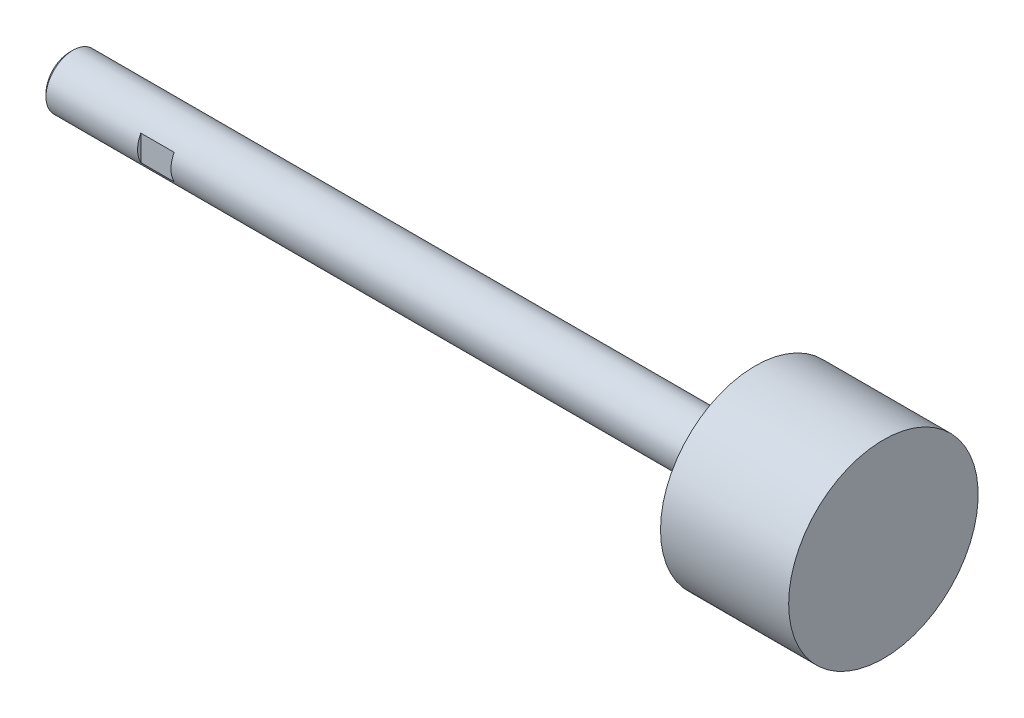
ISO-10303-21;
HEADER;
FILE_DESCRIPTION(('STEP AP214'),'2;1');
FILE_NAME('part.step','',(''),(''),'','','');
FILE_SCHEMA(('AUTOMOTIVE_DESIGN { 1 0 10303 214 1 1 1 1 }'));
ENDSEC;
DATA;
#1=APPLICATION_CONTEXT('core data for automotive mechanical design processes');
#2=APPLICATION_PROTOCOL_DEFINITION('international standard','automotive_design',2000,#1);
#3=PRODUCT_CONTEXT('',#1,'mechanical');
#4=PRODUCT('Part','Part','',(#3));
#5=PRODUCT_RELATED_PRODUCT_CATEGORY('part','',(#4));
#6=PRODUCT_DEFINITION_FORMATION('','',#4);
#7=PRODUCT_DEFINITION_CONTEXT('part definition',#1,'design');
#8=PRODUCT_DEFINITION('design','',#6,#7);
#9=PRODUCT_DEFINITION_SHAPE('','',#8);
#10=(LENGTH_UNIT() NAMED_UNIT(*) SI_UNIT(.MILLI.,.METRE.));
#11=(NAMED_UNIT(*) PLANE_ANGLE_UNIT() SI_UNIT($,.RADIAN.));
#12=(NAMED_UNIT(*) SI_UNIT($,.STERADIAN.) SOLID_ANGLE_UNIT());
#13=UNCERTAINTY_MEASURE_WITH_UNIT(LENGTH_MEASURE(1.E-05),#10,'distance_accuracy_value','');
#14=(GEOMETRIC_REPRESENTATION_CONTEXT(3) GLOBAL_UNCERTAINTY_ASSIGNED_CONTEXT((#13)) GLOBAL_UNIT_ASSIGNED_CONTEXT((#10,
#11,#12)) REPRESENTATION_CONTEXT('',''));
#15=CARTESIAN_POINT('',(0.,0.,0.));
#16=DIRECTION('',(0.,0.,1.));
#17=DIRECTION('',(1.,0.,0.));
#18=AXIS2_PLACEMENT_3D('',#15,#16,#17);
#19=CARTESIAN_POINT('',(161.671,0.,0.));
#20=DIRECTION('',(-1.,0.,0.));
#21=DIRECTION('',(0.,0.,1.));
#22=AXIS2_PLACEMENT_3D('',#19,#20,#21);
#23=CYLINDRICAL_SURFACE('',#22,6.35);
#24=CARTESIAN_POINT('',(0.,0.,0.));
#25=DIRECTION('',(1.,0.,0.));
#26=DIRECTION('',(0.,0.,-1.));
#27=AXIS2_PLACEMENT_3D('',#24,#25,#26);
#28=CIRCLE('',#27,6.35);
#29=CARTESIAN_POINT('',(0.,3.01608289010763,5.588));
#30=VERTEX_POINT('',#29);
#31=CARTESIAN_POINT('',(0.,-3.01608289010763,5.588));
#32=VERTEX_POINT('',#31);
#33=EDGE_CURVE('E45',#30,#32,#28,.T.);
#34=ORIENTED_EDGE('',*,*,#33,.T.);
#35=DIRECTION('',(-1.,0.,0.));
#36=VECTOR('',#35,1.);
#37=CARTESIAN_POINT('',(161.671,-3.01608289010763,5.588));
#38=LINE('',#37,#36);
#39=CARTESIAN_POINT('',(-7.874,-3.01608289010763,5.588));
#40=VERTEX_POINT('',#39);
#41=EDGE_CURVE('E11',#32,#40,#38,.T.);
#42=ORIENTED_EDGE('',*,*,#41,.T.);
#43=CARTESIAN_POINT('',(-7.87399999999999,0.,0.));
#44=DIRECTION('',(1.,0.,0.));
#45=DIRECTION('',(0.,0.,-1.));
#46=AXIS2_PLACEMENT_3D('',#43,#44,#45);
#47=CIRCLE('',#46,6.35);
#48=CARTESIAN_POINT('',(-7.874,3.01608289010763,5.588));
#49=VERTEX_POINT('',#48);
#50=EDGE_CURVE('E96',#49,#40,#47,.T.);
#51=ORIENTED_EDGE('',*,*,#50,.F.);
#52=DIRECTION('',(-1.,0.,0.));
#53=VECTOR('',#52,1.);
#54=CARTESIAN_POINT('',(161.671,3.01608289010763,5.588));
#55=LINE('',#54,#53);
#56=EDGE_CURVE('E98',#49,#30,#55,.F.);
#57=ORIENTED_EDGE('',*,*,#56,.T.);
#58=EDGE_LOOP('',(#34,#42,#51,#57));
#59=FACE_BOUND('',#58,.T.);
#60=CARTESIAN_POINT('',(0.,-3.01608289010763,-5.588));
#61=VERTEX_POINT('',#60);
#62=CARTESIAN_POINT('',(0.,3.01608289010763,-5.588));
#63=VERTEX_POINT('',#62);
#64=EDGE_CURVE('E94',#61,#63,#28,.T.);
#65=ORIENTED_EDGE('',*,*,#64,.T.);
#66=DIRECTION('',(-1.,0.,0.));
#67=VECTOR('',#66,1.);
#68=CARTESIAN_POINT('',(161.671,3.01608289010763,-5.588));
#69=LINE('',#68,#67);
#70=CARTESIAN_POINT('',(-7.874,3.01608289010763,-5.588));
#71=VERTEX_POINT('',#70);
#72=EDGE_CURVE('E93',#63,#71,#69,.T.);
#73=ORIENTED_EDGE('',*,*,#72,.T.);
#74=CARTESIAN_POINT('',(-7.874,-3.01608289010763,-5.588));
#75=VERTEX_POINT('',#74);
#76=EDGE_CURVE('E85',#75,#71,#47,.T.);
#77=ORIENTED_EDGE('',*,*,#76,.F.);
#78=DIRECTION('',(-1.,0.,0.));
#79=VECTOR('',#78,1.);
#80=CARTESIAN_POINT('',(161.671,-3.01608289010763,-5.588));
#81=LINE('',#80,#79);
#82=EDGE_CURVE('E77',#75,#61,#81,.F.);
#83=ORIENTED_EDGE('',*,*,#82,.T.);
#84=EDGE_LOOP('',(#65,#73,#77,#83));
#85=FACE_BOUND('',#84,.T.);
#86=CARTESIAN_POINT('',(131.445,0.,0.));
#87=DIRECTION('',(-1.,0.,0.));
#88=DIRECTION('',(0.,0.,1.));
#89=AXIS2_PLACEMENT_3D('',#86,#87,#88);
#90=CIRCLE('',#89,6.35);
#91=CARTESIAN_POINT('',(131.445,0.,6.35));
#92=VERTEX_POINT('',#91);
#93=EDGE_CURVE('E86',#92,#92,#90,.T.);
#94=ORIENTED_EDGE('',*,*,#93,.T.);
#95=EDGE_LOOP('',(#94));
#96=FACE_BOUND('',#95,.T.);
#97=CARTESIAN_POINT('',(-29.47035,0.,0.));
#98=DIRECTION('',(-1.,0.,0.));
#99=DIRECTION('',(0.,0.,1.));
#100=AXIS2_PLACEMENT_3D('',#97,#98,#99);
#101=CIRCLE('',#100,6.35);
#102=CARTESIAN_POINT('',(-29.47035,0.,6.35));
#103=VERTEX_POINT('',#102);
#104=EDGE_CURVE('E113',#103,#103,#101,.T.);
#105=ORIENTED_EDGE('',*,*,#104,.F.);
#106=EDGE_LOOP('',(#105));
#107=FACE_BOUND('',#106,.T.);
#108=ADVANCED_FACE('F38',(#59,#85,#96,#107),#23,.T.);
#109=CARTESIAN_POINT('',(131.445,6.35,0.));
#110=DIRECTION('',(1.,0.,0.));
#111=DIRECTION('',(0.,0.,-1.));
#112=AXIS2_PLACEMENT_3D('',#109,#110,#111);
#113=PLANE('',#112);
#114=ORIENTED_EDGE('',*,*,#93,.F.);
#115=EDGE_LOOP('',(#114));
#116=FACE_BOUND('',#115,.T.);
#117=CARTESIAN_POINT('',(131.445,0.,0.));
#118=DIRECTION('',(-1.,0.,0.));
#119=DIRECTION('',(0.,0.,1.));
#120=AXIS2_PLACEMENT_3D('',#117,#118,#119);
#121=CIRCLE('',#120,22.34565);
#122=CARTESIAN_POINT('',(131.445,0.,22.34565));
#123=VERTEX_POINT('',#122);
#124=EDGE_CURVE('E122',#123,#123,#121,.T.);
#125=ORIENTED_EDGE('',*,*,#124,.T.);
#126=EDGE_LOOP('',(#125));
#127=FACE_BOUND('',#126,.T.);
#128=ADVANCED_FACE('F129',(#116,#127),#113,.F.);
#129=CARTESIAN_POINT('',(161.671,0.,0.));
#130=DIRECTION('',(-1.,0.,0.));
#131=DIRECTION('',(0.,0.,1.));
#132=AXIS2_PLACEMENT_3D('',#129,#130,#131);
#133=CYLINDRICAL_SURFACE('',#132,22.34565);
#134=ORIENTED_EDGE('',*,*,#124,.F.);
#135=EDGE_LOOP('',(#134));
#136=FACE_BOUND('',#135,.T.);
#137=CARTESIAN_POINT('',(161.671,0.,0.));
#138=DIRECTION('',(-1.,0.,0.));
#139=DIRECTION('',(0.,0.,1.));
#140=AXIS2_PLACEMENT_3D('',#137,#138,#139);
#141=CIRCLE('',#140,22.34565);
#142=CARTESIAN_POINT('',(161.671,0.,22.34565));
#143=VERTEX_POINT('',#142);
#144=EDGE_CURVE('E119',#143,#143,#141,.T.);
#145=ORIENTED_EDGE('',*,*,#144,.T.);
#146=EDGE_LOOP('',(#145));
#147=FACE_BOUND('',#146,.T.);
#148=ADVANCED_FACE('F132',(#136,#147),#133,.T.);
#149=CARTESIAN_POINT('',(161.671,22.34565,0.));
#150=DIRECTION('',(-1.,0.,0.));
#151=DIRECTION('',(0.,0.,1.));
#152=AXIS2_PLACEMENT_3D('',#149,#150,#151);
#153=PLANE('',#152);
#154=ORIENTED_EDGE('',*,*,#144,.F.);
#155=EDGE_LOOP('',(#154));
#156=FACE_BOUND('',#155,.T.);
#157=ADVANCED_FACE('F137',(#156),#153,.F.);
#158=CARTESIAN_POINT('',(-30.226,0.,0.));
#159=DIRECTION('',(1.,0.,0.));
#160=DIRECTION('',(0.,0.,-1.));
#161=AXIS2_PLACEMENT_3D('',#158,#159,#160);
#162=PLANE('',#161);
#163=CARTESIAN_POINT('',(-30.226,0.,0.));
#164=DIRECTION('',(-1.,0.,0.));
#165=DIRECTION('',(0.,0.,1.));
#166=AXIS2_PLACEMENT_3D('',#163,#164,#165);
#167=CIRCLE('',#166,5.59435);
#168=CARTESIAN_POINT('',(-30.226,0.,5.59435));
#169=VERTEX_POINT('',#168);
#170=EDGE_CURVE('E116',#169,#169,#167,.T.);
#171=ORIENTED_EDGE('',*,*,#170,.T.);
#172=EDGE_LOOP('',(#171));
#173=FACE_BOUND('',#172,.T.);
#174=ADVANCED_FACE('F142',(#173),#162,.F.);
#175=CARTESIAN_POINT('',(-29.47035,0.,0.));
#176=DIRECTION('',(1.,0.,0.));
#177=DIRECTION('',(0.,0.,-1.));
#178=AXIS2_PLACEMENT_3D('',#175,#176,#177);
#179=CONICAL_SURFACE('',#178,6.35,0.785398163397448);
#180=ORIENTED_EDGE('',*,*,#170,.F.);
#181=EDGE_LOOP('',(#180));
#182=FACE_BOUND('',#181,.T.);
#183=ORIENTED_EDGE('',*,*,#104,.T.);
#184=EDGE_LOOP('',(#183));
#185=FACE_BOUND('',#184,.T.);
#186=ADVANCED_FACE('F147',(#182,#185),#179,.T.);
#187=CARTESIAN_POINT('',(0.,-6.35,-5.588));
#188=DIRECTION('',(0.,0.,1.));
#189=DIRECTION('',(1.,0.,0.));
#190=AXIS2_PLACEMENT_3D('',#187,#188,#189);
#191=PLANE('',#190);
#192=DIRECTION('',(0.,1.,0.));
#193=VECTOR('',#192,1.);
#194=CARTESIAN_POINT('',(0.,-6.35,-5.588));
#195=LINE('',#194,#193);
#196=EDGE_CURVE('E60',#61,#63,#195,.T.);
#197=ORIENTED_EDGE('',*,*,#196,.F.);
#198=ORIENTED_EDGE('',*,*,#82,.F.);
#199=DIRECTION('',(0.,1.,0.));
#200=VECTOR('',#199,1.);
#201=CARTESIAN_POINT('',(-7.874,-6.35,-5.588));
#202=LINE('',#201,#200);
#203=EDGE_CURVE('E80',#75,#71,#202,.T.);
#204=ORIENTED_EDGE('',*,*,#203,.T.);
#205=ORIENTED_EDGE('',*,*,#72,.F.);
#206=EDGE_LOOP('',(#197,#198,#204,#205));
#207=FACE_BOUND('',#206,.T.);
#208=ADVANCED_FACE('F79',(#207),#191,.F.);
#209=CARTESIAN_POINT('',(-7.874,0.,0.));
#210=DIRECTION('',(1.,0.,0.));
#211=DIRECTION('',(0.,0.,-1.));
#212=AXIS2_PLACEMENT_3D('',#209,#210,#211);
#213=PLANE('',#212);
#214=ORIENTED_EDGE('',*,*,#76,.T.);
#215=ORIENTED_EDGE('',*,*,#203,.F.);
#216=EDGE_LOOP('',(#214,#215));
#217=FACE_BOUND('',#216,.T.);
#218=ADVANCED_FACE('F89',(#217),#213,.T.);
#219=CARTESIAN_POINT('',(0.,0.,0.));
#220=DIRECTION('',(1.,0.,0.));
#221=DIRECTION('',(0.,0.,-1.));
#222=AXIS2_PLACEMENT_3D('',#219,#220,#221);
#223=PLANE('',#222);
#224=ORIENTED_EDGE('',*,*,#196,.T.);
#225=ORIENTED_EDGE('',*,*,#64,.F.);
#226=EDGE_LOOP('',(#224,#225));
#227=FACE_BOUND('',#226,.T.);
#228=ADVANCED_FACE('F203',(#227),#223,.F.);
#229=DIRECTION('',(0.,-1.,0.));
#230=VECTOR('',#229,1.);
#231=CARTESIAN_POINT('',(0.,6.35,5.588));
#232=LINE('',#231,#230);
#233=EDGE_CURVE('E52',#30,#32,#232,.T.);
#234=ORIENTED_EDGE('',*,*,#233,.T.);
#235=ORIENTED_EDGE('',*,*,#33,.F.);
#236=EDGE_LOOP('',(#234,#235));
#237=FACE_BOUND('',#236,.T.);
#238=ADVANCED_FACE('F194',(#237),#223,.F.);
#239=ORIENTED_EDGE('',*,*,#50,.T.);
#240=DIRECTION('',(0.,-1.,0.));
#241=VECTOR('',#240,1.);
#242=CARTESIAN_POINT('',(-7.874,6.35,5.588));
#243=LINE('',#242,#241);
#244=EDGE_CURVE('E90',#49,#40,#243,.T.);
#245=ORIENTED_EDGE('',*,*,#244,.F.);
#246=EDGE_LOOP('',(#239,#245));
#247=FACE_BOUND('',#246,.T.);
#248=ADVANCED_FACE('F108',(#247),#213,.T.);
#249=CARTESIAN_POINT('',(0.,6.35,5.588));
#250=DIRECTION('',(0.,0.,-1.));
#251=DIRECTION('',(-1.,0.,0.));
#252=AXIS2_PLACEMENT_3D('',#249,#250,#251);
#253=PLANE('',#252);
#254=ORIENTED_EDGE('',*,*,#233,.F.);
#255=ORIENTED_EDGE('',*,*,#56,.F.);
#256=ORIENTED_EDGE('',*,*,#244,.T.);
#257=ORIENTED_EDGE('',*,*,#41,.F.);
#258=EDGE_LOOP('',(#254,#255,#256,#257));
#259=FACE_BOUND('',#258,.T.);
#260=ADVANCED_FACE('F107',(#259),#253,.F.);
#261=CLOSED_SHELL('',(#108,#128,#148,#157,#174,#186,#208,#218,#228,#238,#248,#260));
#262=MANIFOLD_SOLID_BREP('B2',#261);
#263=ADVANCED_BREP_SHAPE_REPRESENTATION('',(#18,#262),#14);
#264=SHAPE_DEFINITION_REPRESENTATION(#9,#263);
ENDSEC;
END-ISO-10303-21;
